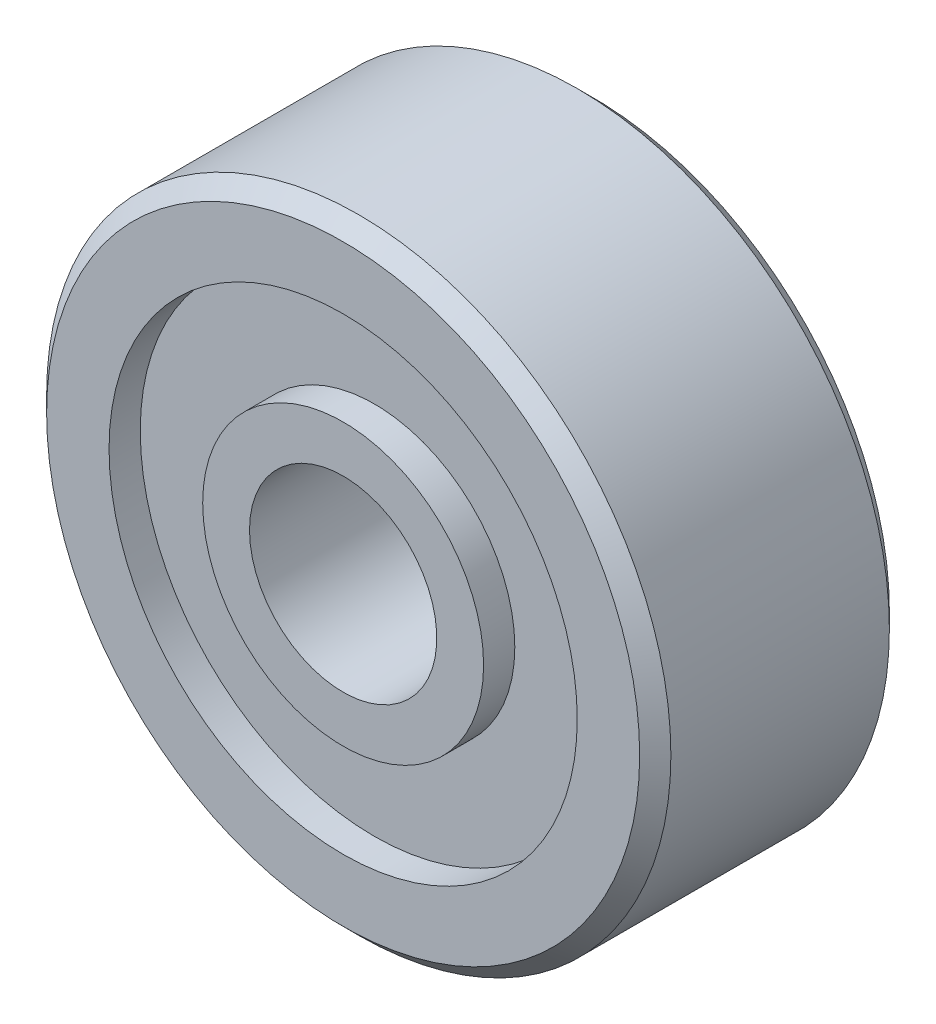
ISO-10303-21;
HEADER;
FILE_DESCRIPTION(('STEP AP214'),'2;1');
FILE_NAME('part.step','',(''),(''),'','','');
FILE_SCHEMA(('AUTOMOTIVE_DESIGN { 1 0 10303 214 1 1 1 1 }'));
ENDSEC;
DATA;
#1=APPLICATION_CONTEXT('core data for automotive mechanical design processes');
#2=APPLICATION_PROTOCOL_DEFINITION('international standard','automotive_design',2000,#1);
#3=PRODUCT_CONTEXT('',#1,'mechanical');
#4=PRODUCT('Part','Part','',(#3));
#5=PRODUCT_RELATED_PRODUCT_CATEGORY('part','',(#4));
#6=PRODUCT_DEFINITION_FORMATION('','',#4);
#7=PRODUCT_DEFINITION_CONTEXT('part definition',#1,'design');
#8=PRODUCT_DEFINITION('design','',#6,#7);
#9=PRODUCT_DEFINITION_SHAPE('','',#8);
#10=(LENGTH_UNIT() NAMED_UNIT(*) SI_UNIT(.MILLI.,.METRE.));
#11=(NAMED_UNIT(*) PLANE_ANGLE_UNIT() SI_UNIT($,.RADIAN.));
#12=(NAMED_UNIT(*) SI_UNIT($,.STERADIAN.) SOLID_ANGLE_UNIT());
#13=UNCERTAINTY_MEASURE_WITH_UNIT(LENGTH_MEASURE(1.E-05),#10,'distance_accuracy_value','');
#14=(GEOMETRIC_REPRESENTATION_CONTEXT(3) GLOBAL_UNCERTAINTY_ASSIGNED_CONTEXT((#13)) GLOBAL_UNIT_ASSIGNED_CONTEXT((#10,
#11,#12)) REPRESENTATION_CONTEXT('',''));
#15=CARTESIAN_POINT('',(0.,0.,0.));
#16=DIRECTION('',(0.,0.,1.));
#17=DIRECTION('',(1.,0.,0.));
#18=AXIS2_PLACEMENT_3D('',#15,#16,#17);
#19=CARTESIAN_POINT('',(1.5,0.,2.5));
#20=DIRECTION('',(0.,0.,-1.));
#21=DIRECTION('',(-1.,0.,0.));
#22=AXIS2_PLACEMENT_3D('',#19,#20,#21);
#23=CYLINDRICAL_SURFACE('',#22,5.);
#24=CARTESIAN_POINT('',(1.5,0.,1.25));
#25=DIRECTION('',(0.,0.,-1.));
#26=DIRECTION('',(-1.,0.,0.));
#27=AXIS2_PLACEMENT_3D('',#24,#25,#26);
#28=CIRCLE('',#27,5.);
#29=CARTESIAN_POINT('',(-3.5,0.,1.25));
#30=VERTEX_POINT('',#29);
#31=EDGE_CURVE('E10',#30,#30,#28,.T.);
#32=ORIENTED_EDGE('',*,*,#31,.T.);
#33=EDGE_LOOP('',(#32));
#34=FACE_BOUND('',#33,.T.);
#35=CARTESIAN_POINT('',(1.5,0.,-2.25));
#36=DIRECTION('',(0.,0.,-1.));
#37=DIRECTION('',(-1.,0.,0.));
#38=AXIS2_PLACEMENT_3D('',#35,#36,#37);
#39=CIRCLE('',#38,5.);
#40=CARTESIAN_POINT('',(-3.5,0.,-2.25));
#41=VERTEX_POINT('',#40);
#42=EDGE_CURVE('E78',#41,#41,#39,.T.);
#43=ORIENTED_EDGE('',*,*,#42,.F.);
#44=EDGE_LOOP('',(#43));
#45=FACE_BOUND('',#44,.T.);
#46=ADVANCED_FACE('F32',(#34,#45),#23,.T.);
#47=CARTESIAN_POINT('',(1.5,0.,1.25));
#48=DIRECTION('',(0.,0.,-1.));
#49=DIRECTION('',(-1.,0.,0.));
#50=AXIS2_PLACEMENT_3D('',#47,#48,#49);
#51=CONICAL_SURFACE('',#50,5.,0.785398163397459);
#52=CARTESIAN_POINT('',(1.5,0.,1.5));
#53=DIRECTION('',(0.,0.,-1.));
#54=DIRECTION('',(-1.,0.,0.));
#55=AXIS2_PLACEMENT_3D('',#52,#53,#54);
#56=CIRCLE('',#55,4.75);
#57=CARTESIAN_POINT('',(-3.25,0.,1.5));
#58=VERTEX_POINT('',#57);
#59=EDGE_CURVE('E38',#58,#58,#56,.T.);
#60=ORIENTED_EDGE('',*,*,#59,.T.);
#61=EDGE_LOOP('',(#60));
#62=FACE_BOUND('',#61,.T.);
#63=ORIENTED_EDGE('',*,*,#31,.F.);
#64=EDGE_LOOP('',(#63));
#65=FACE_BOUND('',#64,.T.);
#66=ADVANCED_FACE('F86',(#62,#65),#51,.T.);
#67=CARTESIAN_POINT('',(6.25,0.,1.5));
#68=DIRECTION('',(0.,0.,1.));
#69=DIRECTION('',(1.,0.,0.));
#70=AXIS2_PLACEMENT_3D('',#67,#68,#69);
#71=PLANE('',#70);
#72=CARTESIAN_POINT('',(1.5,0.,1.5));
#73=DIRECTION('',(0.,0.,-1.));
#74=DIRECTION('',(-1.,0.,0.));
#75=AXIS2_PLACEMENT_3D('',#72,#73,#74);
#76=CIRCLE('',#75,3.75);
#77=CARTESIAN_POINT('',(-2.25,0.,1.5));
#78=VERTEX_POINT('',#77);
#79=EDGE_CURVE('E42',#78,#78,#76,.T.);
#80=ORIENTED_EDGE('',*,*,#79,.T.);
#81=EDGE_LOOP('',(#80));
#82=FACE_BOUND('',#81,.T.);
#83=ORIENTED_EDGE('',*,*,#59,.F.);
#84=EDGE_LOOP('',(#83));
#85=FACE_BOUND('',#84,.T.);
#86=ADVANCED_FACE('F90',(#82,#85),#71,.T.);
#87=CARTESIAN_POINT('',(1.5,0.,2.5));
#88=DIRECTION('',(0.,0.,-1.));
#89=DIRECTION('',(-1.,0.,0.));
#90=AXIS2_PLACEMENT_3D('',#87,#88,#89);
#91=CYLINDRICAL_SURFACE('',#90,3.75);
#92=CARTESIAN_POINT('',(1.5,0.,1.));
#93=DIRECTION('',(0.,0.,-1.));
#94=DIRECTION('',(-1.,0.,0.));
#95=AXIS2_PLACEMENT_3D('',#92,#93,#94);
#96=CIRCLE('',#95,3.75);
#97=CARTESIAN_POINT('',(-2.25,0.,0.999999999999999));
#98=VERTEX_POINT('',#97);
#99=EDGE_CURVE('E46',#98,#98,#96,.T.);
#100=ORIENTED_EDGE('',*,*,#99,.T.);
#101=EDGE_LOOP('',(#100));
#102=FACE_BOUND('',#101,.T.);
#103=ORIENTED_EDGE('',*,*,#79,.F.);
#104=EDGE_LOOP('',(#103));
#105=FACE_BOUND('',#104,.T.);
#106=ADVANCED_FACE('F94',(#102,#105),#91,.F.);
#107=CARTESIAN_POINT('',(5.25,0.,1.));
#108=DIRECTION('',(0.,0.,1.));
#109=DIRECTION('',(1.,0.,0.));
#110=AXIS2_PLACEMENT_3D('',#107,#108,#109);
#111=PLANE('',#110);
#112=CARTESIAN_POINT('',(1.5,0.,0.999999999999999));
#113=DIRECTION('',(0.,0.,-1.));
#114=DIRECTION('',(-1.,0.,0.));
#115=AXIS2_PLACEMENT_3D('',#112,#113,#114);
#116=CIRCLE('',#115,2.25);
#117=CARTESIAN_POINT('',(-0.750000000000001,0.,0.999999999999999));
#118=VERTEX_POINT('',#117);
#119=EDGE_CURVE('E51',#118,#118,#116,.T.);
#120=ORIENTED_EDGE('',*,*,#119,.T.);
#121=EDGE_LOOP('',(#120));
#122=FACE_BOUND('',#121,.T.);
#123=ORIENTED_EDGE('',*,*,#99,.F.);
#124=EDGE_LOOP('',(#123));
#125=FACE_BOUND('',#124,.T.);
#126=ADVANCED_FACE('F101',(#122,#125),#111,.T.);
#127=CARTESIAN_POINT('',(1.5,0.,2.5));
#128=DIRECTION('',(0.,0.,-1.));
#129=DIRECTION('',(-1.,0.,0.));
#130=AXIS2_PLACEMENT_3D('',#127,#128,#129);
#131=CYLINDRICAL_SURFACE('',#130,2.25);
#132=CARTESIAN_POINT('',(1.5,0.,1.5));
#133=DIRECTION('',(0.,0.,-1.));
#134=DIRECTION('',(-1.,0.,0.));
#135=AXIS2_PLACEMENT_3D('',#132,#133,#134);
#136=CIRCLE('',#135,2.25);
#137=CARTESIAN_POINT('',(-0.750000000000001,0.,1.5));
#138=VERTEX_POINT('',#137);
#139=EDGE_CURVE('E54',#138,#138,#136,.T.);
#140=ORIENTED_EDGE('',*,*,#139,.T.);
#141=EDGE_LOOP('',(#140));
#142=FACE_BOUND('',#141,.T.);
#143=ORIENTED_EDGE('',*,*,#119,.F.);
#144=EDGE_LOOP('',(#143));
#145=FACE_BOUND('',#144,.T.);
#146=ADVANCED_FACE('F105',(#142,#145),#131,.T.);
#147=CARTESIAN_POINT('',(3.75,0.,1.5));
#148=DIRECTION('',(0.,0.,1.));
#149=DIRECTION('',(1.,0.,0.));
#150=AXIS2_PLACEMENT_3D('',#147,#148,#149);
#151=PLANE('',#150);
#152=CARTESIAN_POINT('',(1.5,0.,1.5));
#153=DIRECTION('',(0.,0.,-1.));
#154=DIRECTION('',(-1.,0.,0.));
#155=AXIS2_PLACEMENT_3D('',#152,#153,#154);
#156=CIRCLE('',#155,1.5);
#157=CARTESIAN_POINT('',(0.,0.,1.5));
#158=VERTEX_POINT('',#157);
#159=EDGE_CURVE('E57',#158,#158,#156,.T.);
#160=ORIENTED_EDGE('',*,*,#159,.T.);
#161=EDGE_LOOP('',(#160));
#162=FACE_BOUND('',#161,.T.);
#163=ORIENTED_EDGE('',*,*,#139,.F.);
#164=EDGE_LOOP('',(#163));
#165=FACE_BOUND('',#164,.T.);
#166=ADVANCED_FACE('F109',(#162,#165),#151,.T.);
#167=CARTESIAN_POINT('',(1.5,0.,2.5));
#168=DIRECTION('',(0.,0.,-1.));
#169=DIRECTION('',(-1.,0.,0.));
#170=AXIS2_PLACEMENT_3D('',#167,#168,#169);
#171=CYLINDRICAL_SURFACE('',#170,1.5);
#172=CARTESIAN_POINT('',(1.5,0.,-2.5));
#173=DIRECTION('',(0.,0.,-1.));
#174=DIRECTION('',(-1.,0.,0.));
#175=AXIS2_PLACEMENT_3D('',#172,#173,#174);
#176=CIRCLE('',#175,1.5);
#177=CARTESIAN_POINT('',(0.,0.,-2.5));
#178=VERTEX_POINT('',#177);
#179=EDGE_CURVE('E60',#178,#178,#176,.T.);
#180=ORIENTED_EDGE('',*,*,#179,.T.);
#181=EDGE_LOOP('',(#180));
#182=FACE_BOUND('',#181,.T.);
#183=ORIENTED_EDGE('',*,*,#159,.F.);
#184=EDGE_LOOP('',(#183));
#185=FACE_BOUND('',#184,.T.);
#186=ADVANCED_FACE('F113',(#182,#185),#171,.F.);
#187=CARTESIAN_POINT('',(3.,0.,-2.5));
#188=DIRECTION('',(0.,0.,-1.));
#189=DIRECTION('',(-1.,0.,0.));
#190=AXIS2_PLACEMENT_3D('',#187,#188,#189);
#191=PLANE('',#190);
#192=CARTESIAN_POINT('',(1.5,0.,-2.5));
#193=DIRECTION('',(0.,0.,-1.));
#194=DIRECTION('',(-1.,0.,0.));
#195=AXIS2_PLACEMENT_3D('',#192,#193,#194);
#196=CIRCLE('',#195,2.25);
#197=CARTESIAN_POINT('',(-0.749999999999998,0.,-2.5));
#198=VERTEX_POINT('',#197);
#199=EDGE_CURVE('E63',#198,#198,#196,.T.);
#200=ORIENTED_EDGE('',*,*,#199,.T.);
#201=EDGE_LOOP('',(#200));
#202=FACE_BOUND('',#201,.T.);
#203=ORIENTED_EDGE('',*,*,#179,.F.);
#204=EDGE_LOOP('',(#203));
#205=FACE_BOUND('',#204,.T.);
#206=ADVANCED_FACE('F117',(#202,#205),#191,.T.);
#207=CARTESIAN_POINT('',(1.5,0.,2.5));
#208=DIRECTION('',(0.,0.,-1.));
#209=DIRECTION('',(-1.,0.,0.));
#210=AXIS2_PLACEMENT_3D('',#207,#208,#209);
#211=CYLINDRICAL_SURFACE('',#210,2.25);
#212=CARTESIAN_POINT('',(1.5,0.,-2.));
#213=DIRECTION('',(0.,0.,-1.));
#214=DIRECTION('',(-1.,0.,0.));
#215=AXIS2_PLACEMENT_3D('',#212,#213,#214);
#216=CIRCLE('',#215,2.25);
#217=CARTESIAN_POINT('',(-0.749999999999998,0.,-2.));
#218=VERTEX_POINT('',#217);
#219=EDGE_CURVE('E66',#218,#218,#216,.T.);
#220=ORIENTED_EDGE('',*,*,#219,.T.);
#221=EDGE_LOOP('',(#220));
#222=FACE_BOUND('',#221,.T.);
#223=ORIENTED_EDGE('',*,*,#199,.F.);
#224=EDGE_LOOP('',(#223));
#225=FACE_BOUND('',#224,.T.);
#226=ADVANCED_FACE('F121',(#222,#225),#211,.T.);
#227=CARTESIAN_POINT('',(3.75,0.,-2.));
#228=DIRECTION('',(0.,0.,-1.));
#229=DIRECTION('',(-1.,0.,0.));
#230=AXIS2_PLACEMENT_3D('',#227,#228,#229);
#231=PLANE('',#230);
#232=CARTESIAN_POINT('',(1.5,0.,-2.));
#233=DIRECTION('',(0.,0.,-1.));
#234=DIRECTION('',(-1.,0.,0.));
#235=AXIS2_PLACEMENT_3D('',#232,#233,#234);
#236=CIRCLE('',#235,3.75);
#237=CARTESIAN_POINT('',(-2.25,0.,-2.));
#238=VERTEX_POINT('',#237);
#239=EDGE_CURVE('E69',#238,#238,#236,.T.);
#240=ORIENTED_EDGE('',*,*,#239,.T.);
#241=EDGE_LOOP('',(#240));
#242=FACE_BOUND('',#241,.T.);
#243=ORIENTED_EDGE('',*,*,#219,.F.);
#244=EDGE_LOOP('',(#243));
#245=FACE_BOUND('',#244,.T.);
#246=ADVANCED_FACE('F125',(#242,#245),#231,.T.);
#247=CARTESIAN_POINT('',(1.5,0.,2.5));
#248=DIRECTION('',(0.,0.,-1.));
#249=DIRECTION('',(-1.,0.,0.));
#250=AXIS2_PLACEMENT_3D('',#247,#248,#249);
#251=CYLINDRICAL_SURFACE('',#250,3.75);
#252=CARTESIAN_POINT('',(1.5,0.,-2.5));
#253=DIRECTION('',(0.,0.,-1.));
#254=DIRECTION('',(-1.,0.,0.));
#255=AXIS2_PLACEMENT_3D('',#252,#253,#254);
#256=CIRCLE('',#255,3.75);
#257=CARTESIAN_POINT('',(-2.25,0.,-2.5));
#258=VERTEX_POINT('',#257);
#259=EDGE_CURVE('E72',#258,#258,#256,.T.);
#260=ORIENTED_EDGE('',*,*,#259,.T.);
#261=EDGE_LOOP('',(#260));
#262=FACE_BOUND('',#261,.T.);
#263=ORIENTED_EDGE('',*,*,#239,.F.);
#264=EDGE_LOOP('',(#263));
#265=FACE_BOUND('',#264,.T.);
#266=ADVANCED_FACE('F129',(#262,#265),#251,.F.);
#267=CARTESIAN_POINT('',(5.25,0.,-2.5));
#268=DIRECTION('',(0.,0.,-1.));
#269=DIRECTION('',(-1.,0.,0.));
#270=AXIS2_PLACEMENT_3D('',#267,#268,#269);
#271=PLANE('',#270);
#272=CARTESIAN_POINT('',(1.5,0.,-2.5));
#273=DIRECTION('',(0.,0.,-1.));
#274=DIRECTION('',(-1.,0.,0.));
#275=AXIS2_PLACEMENT_3D('',#272,#273,#274);
#276=CIRCLE('',#275,4.75);
#277=CARTESIAN_POINT('',(-3.25,0.,-2.5));
#278=VERTEX_POINT('',#277);
#279=EDGE_CURVE('E75',#278,#278,#276,.T.);
#280=ORIENTED_EDGE('',*,*,#279,.T.);
#281=EDGE_LOOP('',(#280));
#282=FACE_BOUND('',#281,.T.);
#283=ORIENTED_EDGE('',*,*,#259,.F.);
#284=EDGE_LOOP('',(#283));
#285=FACE_BOUND('',#284,.T.);
#286=ADVANCED_FACE('F133',(#282,#285),#271,.T.);
#287=CARTESIAN_POINT('',(1.5,0.,-2.5));
#288=DIRECTION('',(0.,0.,1.));
#289=DIRECTION('',(1.,0.,0.));
#290=AXIS2_PLACEMENT_3D('',#287,#288,#289);
#291=CONICAL_SURFACE('',#290,4.75,0.785398163397453);
#292=ORIENTED_EDGE('',*,*,#42,.T.);
#293=EDGE_LOOP('',(#292));
#294=FACE_BOUND('',#293,.T.);
#295=ORIENTED_EDGE('',*,*,#279,.F.);
#296=EDGE_LOOP('',(#295));
#297=FACE_BOUND('',#296,.T.);
#298=ADVANCED_FACE('F82',(#294,#297),#291,.T.);
#299=CLOSED_SHELL('',(#46,#66,#86,#106,#126,#146,#166,#186,#206,#226,#246,#266,#286,#298));
#300=MANIFOLD_SOLID_BREP('B2',#299);
#301=ADVANCED_BREP_SHAPE_REPRESENTATION('',(#18,#300),#14);
#302=SHAPE_DEFINITION_REPRESENTATION(#9,#301);
ENDSEC;
END-ISO-10303-21;
